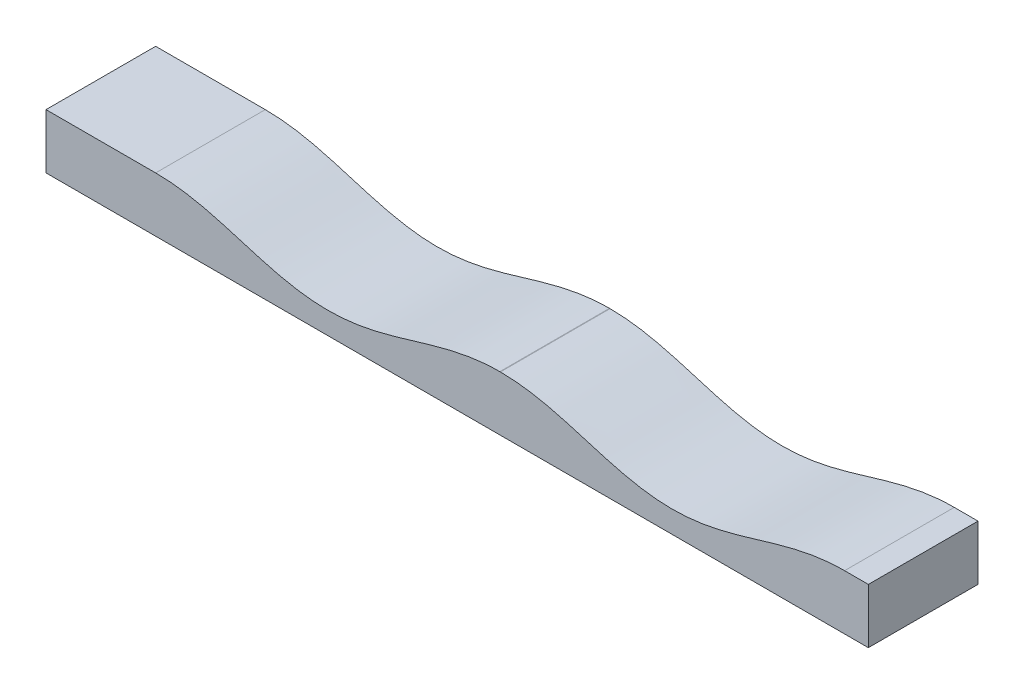
ISO-10303-21;
HEADER;
FILE_DESCRIPTION(('STEP AP214'),'2;1');
FILE_NAME('part.step','',(''),(''),'','','');
FILE_SCHEMA(('AUTOMOTIVE_DESIGN { 1 0 10303 214 1 1 1 1 }'));
ENDSEC;
DATA;
#1=APPLICATION_CONTEXT('core data for automotive mechanical design processes');
#2=APPLICATION_PROTOCOL_DEFINITION('international standard','automotive_design',2000,#1);
#3=PRODUCT_CONTEXT('',#1,'mechanical');
#4=PRODUCT('Part','Part','',(#3));
#5=PRODUCT_RELATED_PRODUCT_CATEGORY('part','',(#4));
#6=PRODUCT_DEFINITION_FORMATION('','',#4);
#7=PRODUCT_DEFINITION_CONTEXT('part definition',#1,'design');
#8=PRODUCT_DEFINITION('design','',#6,#7);
#9=PRODUCT_DEFINITION_SHAPE('','',#8);
#10=(LENGTH_UNIT() NAMED_UNIT(*) SI_UNIT(.MILLI.,.METRE.));
#11=(NAMED_UNIT(*) PLANE_ANGLE_UNIT() SI_UNIT($,.RADIAN.));
#12=(NAMED_UNIT(*) SI_UNIT($,.STERADIAN.) SOLID_ANGLE_UNIT());
#13=UNCERTAINTY_MEASURE_WITH_UNIT(LENGTH_MEASURE(1.E-05),#10,'distance_accuracy_value','');
#14=(GEOMETRIC_REPRESENTATION_CONTEXT(3) GLOBAL_UNCERTAINTY_ASSIGNED_CONTEXT((#13)) GLOBAL_UNIT_ASSIGNED_CONTEXT((#10,
#11,#12)) REPRESENTATION_CONTEXT('',''));
#15=CARTESIAN_POINT('',(0.,0.,0.));
#16=DIRECTION('',(0.,0.,1.));
#17=DIRECTION('',(1.,0.,0.));
#18=AXIS2_PLACEMENT_3D('',#15,#16,#17);
#19=CARTESIAN_POINT('',(0.,10.,0.));
#20=DIRECTION('',(0.,1.,0.));
#21=DIRECTION('',(0.,0.,1.));
#22=AXIS2_PLACEMENT_3D('',#19,#20,#21);
#23=PLANE('',#22);
#24=DIRECTION('',(0.,0.,1.));
#25=VECTOR('',#24,1.);
#26=CARTESIAN_POINT('',(20.,10.,-10.));
#27=LINE('',#26,#25);
#28=CARTESIAN_POINT('',(20.,10.,-10.));
#29=VERTEX_POINT('',#28);
#30=CARTESIAN_POINT('',(20.,10.,10.));
#31=VERTEX_POINT('',#30);
#32=EDGE_CURVE('E129',#29,#31,#27,.T.);
#33=ORIENTED_EDGE('',*,*,#32,.F.);
#34=DIRECTION('',(-1.,0.,0.));
#35=VECTOR('',#34,1.);
#36=CARTESIAN_POINT('',(150.,10.,-10.));
#37=LINE('',#36,#35);
#38=CARTESIAN_POINT('',(0.,10.,-10.));
#39=VERTEX_POINT('',#38);
#40=EDGE_CURVE('E124',#29,#39,#37,.T.);
#41=ORIENTED_EDGE('',*,*,#40,.T.);
#42=DIRECTION('',(0.,0.,1.));
#43=VECTOR('',#42,1.);
#44=CARTESIAN_POINT('',(0.,10.,10.));
#45=LINE('',#44,#43);
#46=CARTESIAN_POINT('',(0.,10.,10.));
#47=VERTEX_POINT('',#46);
#48=EDGE_CURVE('E126',#39,#47,#45,.T.);
#49=ORIENTED_EDGE('',*,*,#48,.T.);
#50=DIRECTION('',(1.,0.,0.));
#51=VECTOR('',#50,1.);
#52=CARTESIAN_POINT('',(150.,10.,9.99999999999998));
#53=LINE('',#52,#51);
#54=EDGE_CURVE('E107',#47,#31,#53,.T.);
#55=ORIENTED_EDGE('',*,*,#54,.T.);
#56=EDGE_LOOP('',(#33,#41,#49,#55));
#57=FACE_BOUND('',#56,.T.);
#58=ADVANCED_FACE('F33',(#57),#23,.T.);
#59=CARTESIAN_POINT('',(150.,10.,-10.));
#60=VERTEX_POINT('',#59);
#61=CARTESIAN_POINT('',(145.663706143612,10.,-10.));
#62=VERTEX_POINT('',#61);
#63=EDGE_CURVE('E132',#60,#62,#37,.T.);
#64=ORIENTED_EDGE('',*,*,#63,.T.);
#65=DIRECTION('',(0.,0.,1.));
#66=VECTOR('',#65,1.);
#67=CARTESIAN_POINT('',(145.663706143612,10.,-10.));
#68=LINE('',#67,#66);
#69=CARTESIAN_POINT('',(145.663706143613,10.,9.99999999999998));
#70=VERTEX_POINT('',#69);
#71=EDGE_CURVE('E145',#62,#70,#68,.T.);
#72=ORIENTED_EDGE('',*,*,#71,.T.);
#73=CARTESIAN_POINT('',(150.,10.,9.99999999999998));
#74=VERTEX_POINT('',#73);
#75=EDGE_CURVE('E140',#70,#74,#53,.T.);
#76=ORIENTED_EDGE('',*,*,#75,.T.);
#77=DIRECTION('',(0.,0.,-1.));
#78=VECTOR('',#77,1.);
#79=CARTESIAN_POINT('',(150.,10.,9.99999999999998));
#80=LINE('',#79,#78);
#81=EDGE_CURVE('E119',#74,#60,#80,.T.);
#82=ORIENTED_EDGE('',*,*,#81,.T.);
#83=EDGE_LOOP('',(#64,#72,#76,#82));
#84=FACE_BOUND('',#83,.T.);
#85=ADVANCED_FACE('F185',(#84),#23,.T.);
#86=CARTESIAN_POINT('',(0.,10.,10.));
#87=DIRECTION('',(1.,0.,0.));
#88=DIRECTION('',(0.,0.,-1.));
#89=AXIS2_PLACEMENT_3D('',#86,#87,#88);
#90=PLANE('',#89);
#91=DIRECTION('',(0.,0.,1.));
#92=VECTOR('',#91,1.);
#93=CARTESIAN_POINT('',(0.,0.,10.));
#94=LINE('',#93,#92);
#95=CARTESIAN_POINT('',(0.,0.,-10.));
#96=VERTEX_POINT('',#95);
#97=CARTESIAN_POINT('',(0.,0.,10.));
#98=VERTEX_POINT('',#97);
#99=EDGE_CURVE('E149',#96,#98,#94,.T.);
#100=ORIENTED_EDGE('',*,*,#99,.T.);
#101=DIRECTION('',(0.,-1.,0.));
#102=VECTOR('',#101,1.);
#103=CARTESIAN_POINT('',(0.,10.,10.));
#104=LINE('',#103,#102);
#105=EDGE_CURVE('E139',#47,#98,#104,.T.);
#106=ORIENTED_EDGE('',*,*,#105,.F.);
#107=ORIENTED_EDGE('',*,*,#48,.F.);
#108=DIRECTION('',(0.,-1.,0.));
#109=VECTOR('',#108,1.);
#110=CARTESIAN_POINT('',(0.,10.,-10.));
#111=LINE('',#110,#109);
#112=EDGE_CURVE('E133',#39,#96,#111,.T.);
#113=ORIENTED_EDGE('',*,*,#112,.T.);
#114=EDGE_LOOP('',(#100,#106,#107,#113));
#115=FACE_BOUND('',#114,.T.);
#116=ADVANCED_FACE('F35',(#115),#90,.F.);
#117=CARTESIAN_POINT('',(150.,10.,9.99999999999998));
#118=DIRECTION('',(0.,0.,-1.));
#119=DIRECTION('',(-1.,0.,0.));
#120=AXIS2_PLACEMENT_3D('',#117,#118,#119);
#121=PLANE('',#120);
#122=DIRECTION('',(1.,0.,0.));
#123=VECTOR('',#122,1.);
#124=CARTESIAN_POINT('',(0.,10.,9.99999999999999));
#125=LINE('',#124,#123);
#126=CARTESIAN_POINT('',(82.7780737696727,10.0000000000001,9.99999999999999));
#127=VERTEX_POINT('',#126);
#128=CARTESIAN_POINT('',(82.8856278761466,10.,9.99999999999999));
#129=VERTEX_POINT('',#128);
#130=EDGE_CURVE('E37',#127,#129,#125,.T.);
#131=ORIENTED_EDGE('',*,*,#130,.F.);
#132=CARTESIAN_POINT('',(19.9999999999975,10.,10.));
#133=CARTESIAN_POINT('',(20.0607614423715,10.,10.));
#134=CARTESIAN_POINT('',(20.1824214553506,9.9995753970691,10.));
#135=CARTESIAN_POINT('',(20.3973010297231,9.99766468458234,10.));
#136=CARTESIAN_POINT('',(20.7149855545771,9.99257239572288,10.));
#137=CARTESIAN_POINT('',(21.1005637112447,9.98303353547104,10.));
#138=CARTESIAN_POINT('',(21.5318509676293,9.96652686291294,10.));
#139=CARTESIAN_POINT('',(22.0362572209401,9.93994091498935,10.));
#140=CARTESIAN_POINT('',(22.6209438510357,9.89964533359765,10.));
#141=CARTESIAN_POINT('',(23.3457874969873,9.83711346640637,10.));
#142=CARTESIAN_POINT('',(24.0967998850118,9.75589638188363,10.));
#143=CARTESIAN_POINT('',(24.8714562356159,9.65480784470362,10.));
#144=CARTESIAN_POINT('',(25.8401527120131,9.50702943030351,10.));
#145=CARTESIAN_POINT('',(26.6877130400076,9.3582480578721,10.));
#146=CARTESIAN_POINT('',(27.5320763279749,9.1920716078163,10.));
#147=CARTESIAN_POINT('',(28.3731353334549,9.01027021530613,10.));
#148=CARTESIAN_POINT('',(29.0440680002337,8.85619443792739,10.));
#149=CARTESIAN_POINT('',(30.1123379454453,8.59757408907099,10.));
#150=CARTESIAN_POINT('',(31.5728561000633,8.21429539495773,10.));
#151=CARTESIAN_POINT('',(33.4199103147685,7.68752673585901,10.));
#152=CARTESIAN_POINT('',(35.6526320552214,7.0168103480453,10.));
#153=CARTESIAN_POINT('',(37.7332722524778,6.39085142574939,10.));
#154=CARTESIAN_POINT('',(39.6691065376285,5.8342663575982,10.));
#155=CARTESIAN_POINT('',(41.872853104551,5.24908154098412,10.));
#156=CARTESIAN_POINT('',(44.6637685236702,4.60848965346651,10.));
#157=CARTESIAN_POINT('',(48.2286943420231,4.04054839894605,10.));
#158=CARTESIAN_POINT('',(52.5867052144305,3.88102484164541,10.));
#159=CARTESIAN_POINT('',(57.201452939956,4.37709005122981,10.));
#160=CARTESIAN_POINT('',(61.687417048679,5.38478965660527,10.));
#161=CARTESIAN_POINT('',(65.9249231356225,6.62915064675429,10.));
#162=CARTESIAN_POINT('',(69.9774506351203,7.87353460738467,10.));
#163=CARTESIAN_POINT('',(74.1045600785184,8.99396689287309,10.));
#164=CARTESIAN_POINT('',(78.3422548229217,9.81457881032495,10.));
#165=CARTESIAN_POINT('',(82.8318529583171,10.1407757520958,10.));
#166=CARTESIAN_POINT('',(87.3214515689638,9.81457806232818,10.));
#167=CARTESIAN_POINT('',(91.5591457236881,8.99396862697276,10.));
#168=CARTESIAN_POINT('',(95.6862561059864,7.87353082037432,10.));
#169=CARTESIAN_POINT('',(99.7387819686486,6.62915770474275,10.));
#170=CARTESIAN_POINT('',(103.976290754997,5.38477812130336,10.));
#171=CARTESIAN_POINT('',(108.462250932461,4.37710595153992,10.));
#172=CARTESIAN_POINT('',(113.077004559588,3.88099935194093,10.));
#173=CARTESIAN_POINT('',(117.435005853124,4.0405901940327,10.));
#174=CARTESIAN_POINT('',(121.41960599233,4.67527178659605,10.));
#175=CARTESIAN_POINT('',(124.770171836118,5.48619692133274,10.));
#176=CARTESIAN_POINT('',(127.52412356252,6.26878856578808,10.));
#177=CARTESIAN_POINT('',(130.011090760973,7.01671326427886,10.));
#178=CARTESIAN_POINT('',(132.243780846713,7.68759639851357,10.));
#179=CARTESIAN_POINT('',(134.256371731303,8.2614501848802,10.));
#180=CARTESIAN_POINT('',(136.05114097296,8.72731142896462,10.));
#181=CARTESIAN_POINT('',(137.625546339694,9.08974664565643,10.));
#182=CARTESIAN_POINT('',(138.975122407524,9.36260296407756,10.));
#183=CARTESIAN_POINT('',(140.280663194219,9.58482608235431,10.));
#184=CARTESIAN_POINT('',(141.395781757496,9.73738392010121,10.));
#185=CARTESIAN_POINT('',(142.317885087465,9.83711244946201,10.));
#186=CARTESIAN_POINT('',(143.042775212016,9.89964574609589,10.));
#187=CARTESIAN_POINT('',(143.62744465041,9.93994077490814,10.));
#188=CARTESIAN_POINT('',(144.131855587126,9.96652687676075,10.));
#189=CARTESIAN_POINT('',(144.563142561625,9.98303353993483,10.));
#190=CARTESIAN_POINT('',(144.948720651122,9.99257239768348,10.));
#191=CARTESIAN_POINT('',(145.266405121889,9.99766468474359,10.));
#192=CARTESIAN_POINT('',(145.481284705766,9.99957539731208,10.));
#193=CARTESIAN_POINT('',(145.602944701242,10.,10.));
#194=CARTESIAN_POINT('',(145.663706143613,10.,10.));
#195=B_SPLINE_CURVE_WITH_KNOTS('',4,(#132,#133,#134,#135,#136,#137,#138,#139,#140,#141,#142,
#143,#144,#145,#146,#147,#148,#149,#150,#151,#152,#153,#154,#155,#156,#157,#158,#159,#160,#161,
#162,#163,#164,#165,#166,#167,#168,#169,#170,#171,#172,#173,#174,#175,#176,#177,#178,#179,#180,
#181,#182,#183,#184,#185,#186,#187,#188,#189,#190,#191,#192,#193,#194),.UNSPECIFIED.,.F.,.F.,(5,
1,1,1,1,1,1,1,1,1,1,1,1,1,1,1,1,1,1,1,1,1,1,1,1,1,1,1,1,1,1,1,1,1,1,1,1,1,1,1,1,1,1,1,1,1,1,1,1,
1,1,1,1,1,1,1,1,1,1,5),(0.082984761646715,0.0848769766356949,0.0867691916246747,
0.0886614066136545,0.0905536216026343,0.094338051580594,0.0981224815585536,0.101906911536513,
0.105691341514473,0.113260201470392,0.117730016392172,0.122199831313951,0.13113946115751,
0.135609276079289,0.140079091001069,0.144548905922848,0.149018720844627,0.164156480476509,
0.179294240108391,0.194431999740273,0.209569759372155,0.22058934305514,0.231608926738126,
0.253648094104097,0.283923524750503,0.314198968730596,0.344474466408915,0.37383219417635,
0.403189921943786,0.428888353248252,0.454586784552718,0.484862298741238,0.515137701258754,
0.545413215447273,0.571111646751734,0.596810078056196,0.626167805823633,0.65552553359107,
0.685801031269389,0.71607647524948,0.746351905895884,0.76839107326185,0.790430240627816,
0.805568000259697,0.820705759891578,0.835843519523459,0.850981279155341,0.859920908998902,
0.868860538842462,0.877800168686023,0.886739798529584,0.894308658485508,0.89809308846347,
0.901877518441432,0.905661948419394,0.909446378397356,0.911338593386337,0.913230808375318,
0.9151230233643,0.917015238353281),.UNSPECIFIED.);
#196=EDGE_CURVE('E207',#31,#127,#195,.T.);
#197=ORIENTED_EDGE('',*,*,#196,.F.);
#198=ORIENTED_EDGE('',*,*,#54,.F.);
#199=ORIENTED_EDGE('',*,*,#105,.T.);
#200=DIRECTION('',(1.,0.,0.));
#201=VECTOR('',#200,1.);
#202=CARTESIAN_POINT('',(150.,0.,9.99999999999998));
#203=LINE('',#202,#201);
#204=CARTESIAN_POINT('',(150.,0.,9.99999999999998));
#205=VERTEX_POINT('',#204);
#206=EDGE_CURVE('E82',#98,#205,#203,.T.);
#207=ORIENTED_EDGE('',*,*,#206,.T.);
#208=DIRECTION('',(0.,-1.,0.));
#209=VECTOR('',#208,1.);
#210=CARTESIAN_POINT('',(150.,10.,9.99999999999998));
#211=LINE('',#210,#209);
#212=EDGE_CURVE('E154',#74,#205,#211,.T.);
#213=ORIENTED_EDGE('',*,*,#212,.F.);
#214=ORIENTED_EDGE('',*,*,#75,.F.);
#215=CARTESIAN_POINT('',(19.9999999999975,10.,10.));
#216=CARTESIAN_POINT('',(20.0607614423715,10.,10.));
#217=CARTESIAN_POINT('',(20.1824214553506,9.9995753970691,10.));
#218=CARTESIAN_POINT('',(20.3973010297231,9.99766468458234,10.));
#219=CARTESIAN_POINT('',(20.7149855545771,9.99257239572288,10.));
#220=CARTESIAN_POINT('',(21.1005637112447,9.98303353547104,10.));
#221=CARTESIAN_POINT('',(21.5318509676293,9.96652686291294,10.));
#222=CARTESIAN_POINT('',(22.0362572209401,9.93994091498935,10.));
#223=CARTESIAN_POINT('',(22.6209438510357,9.89964533359765,10.));
#224=CARTESIAN_POINT('',(23.3457874969873,9.83711346640637,10.));
#225=CARTESIAN_POINT('',(24.0967998850118,9.75589638188363,10.));
#226=CARTESIAN_POINT('',(24.8714562356159,9.65480784470362,10.));
#227=CARTESIAN_POINT('',(25.8401527120131,9.50702943030351,10.));
#228=CARTESIAN_POINT('',(26.6877130400076,9.3582480578721,10.));
#229=CARTESIAN_POINT('',(27.5320763279749,9.1920716078163,10.));
#230=CARTESIAN_POINT('',(28.3731353334549,9.01027021530613,10.));
#231=CARTESIAN_POINT('',(29.0440680002337,8.85619443792739,10.));
#232=CARTESIAN_POINT('',(30.1123379454453,8.59757408907099,10.));
#233=CARTESIAN_POINT('',(31.5728561000633,8.21429539495773,10.));
#234=CARTESIAN_POINT('',(33.4199103147685,7.68752673585901,10.));
#235=CARTESIAN_POINT('',(35.6526320552214,7.0168103480453,10.));
#236=CARTESIAN_POINT('',(37.7332722524778,6.39085142574939,10.));
#237=CARTESIAN_POINT('',(39.6691065376285,5.8342663575982,10.));
#238=CARTESIAN_POINT('',(41.872853104551,5.24908154098412,10.));
#239=CARTESIAN_POINT('',(44.6637685236702,4.60848965346651,10.));
#240=CARTESIAN_POINT('',(48.2286943420231,4.04054839894605,10.));
#241=CARTESIAN_POINT('',(52.5867052144305,3.88102484164541,10.));
#242=CARTESIAN_POINT('',(57.201452939956,4.37709005122981,10.));
#243=CARTESIAN_POINT('',(61.687417048679,5.38478965660527,10.));
#244=CARTESIAN_POINT('',(65.9249231356225,6.62915064675429,10.));
#245=CARTESIAN_POINT('',(69.9774506351203,7.87353460738467,10.));
#246=CARTESIAN_POINT('',(74.1045600785184,8.99396689287309,10.));
#247=CARTESIAN_POINT('',(78.3422548229217,9.81457881032495,10.));
#248=CARTESIAN_POINT('',(82.8318529583171,10.1407757520958,10.));
#249=CARTESIAN_POINT('',(87.3214515689638,9.81457806232818,10.));
#250=CARTESIAN_POINT('',(91.5591457236881,8.99396862697276,10.));
#251=CARTESIAN_POINT('',(95.6862561059864,7.87353082037432,10.));
#252=CARTESIAN_POINT('',(99.7387819686486,6.62915770474275,10.));
#253=CARTESIAN_POINT('',(103.976290754997,5.38477812130336,10.));
#254=CARTESIAN_POINT('',(108.462250932461,4.37710595153992,10.));
#255=CARTESIAN_POINT('',(113.077004559588,3.88099935194093,10.));
#256=CARTESIAN_POINT('',(117.435005853124,4.0405901940327,10.));
#257=CARTESIAN_POINT('',(121.41960599233,4.67527178659605,10.));
#258=CARTESIAN_POINT('',(124.770171836118,5.48619692133274,10.));
#259=CARTESIAN_POINT('',(127.52412356252,6.26878856578808,10.));
#260=CARTESIAN_POINT('',(130.011090760973,7.01671326427886,10.));
#261=CARTESIAN_POINT('',(132.243780846713,7.68759639851357,10.));
#262=CARTESIAN_POINT('',(134.256371731303,8.2614501848802,10.));
#263=CARTESIAN_POINT('',(136.05114097296,8.72731142896462,10.));
#264=CARTESIAN_POINT('',(137.625546339694,9.08974664565643,10.));
#265=CARTESIAN_POINT('',(138.975122407524,9.36260296407756,10.));
#266=CARTESIAN_POINT('',(140.280663194219,9.58482608235431,10.));
#267=CARTESIAN_POINT('',(141.395781757496,9.73738392010121,10.));
#268=CARTESIAN_POINT('',(142.317885087465,9.83711244946201,10.));
#269=CARTESIAN_POINT('',(143.042775212016,9.89964574609589,10.));
#270=CARTESIAN_POINT('',(143.62744465041,9.93994077490814,10.));
#271=CARTESIAN_POINT('',(144.131855587126,9.96652687676075,10.));
#272=CARTESIAN_POINT('',(144.563142561625,9.98303353993483,10.));
#273=CARTESIAN_POINT('',(144.948720651122,9.99257239768348,10.));
#274=CARTESIAN_POINT('',(145.266405121889,9.99766468474359,10.));
#275=CARTESIAN_POINT('',(145.481284705766,9.99957539731208,10.));
#276=CARTESIAN_POINT('',(145.602944701242,10.,10.));
#277=CARTESIAN_POINT('',(145.663706143613,10.,10.));
#278=B_SPLINE_CURVE_WITH_KNOTS('',4,(#215,#216,#217,#218,#219,#220,#221,#222,#223,#224,#225,
#226,#227,#228,#229,#230,#231,#232,#233,#234,#235,#236,#237,#238,#239,#240,#241,#242,#243,#244,
#245,#246,#247,#248,#249,#250,#251,#252,#253,#254,#255,#256,#257,#258,#259,#260,#261,#262,#263,
#264,#265,#266,#267,#268,#269,#270,#271,#272,#273,#274,#275,#276,#277),.UNSPECIFIED.,.F.,.F.,(5,
1,1,1,1,1,1,1,1,1,1,1,1,1,1,1,1,1,1,1,1,1,1,1,1,1,1,1,1,1,1,1,1,1,1,1,1,1,1,1,1,1,1,1,1,1,1,1,1,
1,1,1,1,1,1,1,1,1,1,5),(0.082984761646715,0.0848769766356949,0.0867691916246747,
0.0886614066136545,0.0905536216026343,0.094338051580594,0.0981224815585536,0.101906911536513,
0.105691341514473,0.113260201470392,0.117730016392172,0.122199831313951,0.13113946115751,
0.135609276079289,0.140079091001069,0.144548905922848,0.149018720844627,0.164156480476509,
0.179294240108391,0.194431999740273,0.209569759372155,0.22058934305514,0.231608926738126,
0.253648094104097,0.283923524750503,0.314198968730596,0.344474466408915,0.37383219417635,
0.403189921943786,0.428888353248252,0.454586784552718,0.484862298741238,0.515137701258754,
0.545413215447273,0.571111646751734,0.596810078056196,0.626167805823633,0.65552553359107,
0.685801031269389,0.71607647524948,0.746351905895884,0.76839107326185,0.790430240627816,
0.805568000259697,0.820705759891578,0.835843519523459,0.850981279155341,0.859920908998902,
0.868860538842462,0.877800168686023,0.886739798529584,0.894308658485508,0.89809308846347,
0.901877518441432,0.905661948419394,0.909446378397356,0.911338593386337,0.913230808375318,
0.9151230233643,0.917015238353281),.UNSPECIFIED.);
#279=EDGE_CURVE('E52',#129,#70,#278,.T.);
#280=ORIENTED_EDGE('',*,*,#279,.F.);
#281=EDGE_LOOP('',(#131,#197,#198,#199,#207,#213,#214,#280));
#282=FACE_BOUND('',#281,.T.);
#283=ADVANCED_FACE('F160',(#282),#121,.F.);
#284=CARTESIAN_POINT('',(150.,10.,9.99999999999998));
#285=DIRECTION('',(-1.,0.,0.));
#286=DIRECTION('',(0.,0.,1.));
#287=AXIS2_PLACEMENT_3D('',#284,#285,#286);
#288=PLANE('',#287);
#289=DIRECTION('',(0.,0.,-1.));
#290=VECTOR('',#289,1.);
#291=CARTESIAN_POINT('',(150.,0.,9.99999999999998));
#292=LINE('',#291,#290);
#293=CARTESIAN_POINT('',(150.,0.,-10.));
#294=VERTEX_POINT('',#293);
#295=EDGE_CURVE('E92',#205,#294,#292,.T.);
#296=ORIENTED_EDGE('',*,*,#295,.T.);
#297=DIRECTION('',(0.,-1.,0.));
#298=VECTOR('',#297,1.);
#299=CARTESIAN_POINT('',(150.,10.,-10.));
#300=LINE('',#299,#298);
#301=EDGE_CURVE('E137',#60,#294,#300,.T.);
#302=ORIENTED_EDGE('',*,*,#301,.F.);
#303=ORIENTED_EDGE('',*,*,#81,.F.);
#304=ORIENTED_EDGE('',*,*,#212,.T.);
#305=EDGE_LOOP('',(#296,#302,#303,#304));
#306=FACE_BOUND('',#305,.T.);
#307=ADVANCED_FACE('F190',(#306),#288,.F.);
#308=CARTESIAN_POINT('',(150.,10.,-10.));
#309=DIRECTION('',(0.,0.,1.));
#310=DIRECTION('',(1.,0.,0.));
#311=AXIS2_PLACEMENT_3D('',#308,#309,#310);
#312=PLANE('',#311);
#313=ORIENTED_EDGE('',*,*,#40,.F.);
#314=CARTESIAN_POINT('',(19.9999999999975,10.,-10.));
#315=CARTESIAN_POINT('',(20.0607614423715,10.,-10.));
#316=CARTESIAN_POINT('',(20.1824214553506,9.9995753970691,-10.));
#317=CARTESIAN_POINT('',(20.3973010297231,9.99766468458234,-10.));
#318=CARTESIAN_POINT('',(20.7149855545771,9.99257239572288,-10.));
#319=CARTESIAN_POINT('',(21.1005637112447,9.98303353547104,-10.));
#320=CARTESIAN_POINT('',(21.5318509676293,9.96652686291294,-10.));
#321=CARTESIAN_POINT('',(22.0362572209401,9.93994091498935,-10.));
#322=CARTESIAN_POINT('',(22.6209438510357,9.89964533359765,-10.));
#323=CARTESIAN_POINT('',(23.3457874969873,9.83711346640637,-10.));
#324=CARTESIAN_POINT('',(24.0967998850118,9.75589638188363,-10.));
#325=CARTESIAN_POINT('',(24.8714562356159,9.65480784470362,-10.));
#326=CARTESIAN_POINT('',(25.8401527120131,9.50702943030351,-10.));
#327=CARTESIAN_POINT('',(26.6877130400076,9.3582480578721,-10.));
#328=CARTESIAN_POINT('',(27.5320763279749,9.1920716078163,-10.));
#329=CARTESIAN_POINT('',(28.3731353334549,9.01027021530613,-10.));
#330=CARTESIAN_POINT('',(29.0440680002337,8.85619443792739,-10.));
#331=CARTESIAN_POINT('',(30.1123379454453,8.59757408907099,-10.));
#332=CARTESIAN_POINT('',(31.5728561000633,8.21429539495773,-10.));
#333=CARTESIAN_POINT('',(33.4199103147685,7.68752673585901,-10.));
#334=CARTESIAN_POINT('',(35.6526320552214,7.0168103480453,-10.));
#335=CARTESIAN_POINT('',(37.7332722524778,6.39085142574939,-10.));
#336=CARTESIAN_POINT('',(39.6691065376285,5.8342663575982,-10.));
#337=CARTESIAN_POINT('',(41.872853104551,5.24908154098412,-10.));
#338=CARTESIAN_POINT('',(44.6637685236702,4.60848965346651,-10.));
#339=CARTESIAN_POINT('',(48.2286943420231,4.04054839894605,-10.));
#340=CARTESIAN_POINT('',(52.5867052144305,3.88102484164541,-10.));
#341=CARTESIAN_POINT('',(57.201452939956,4.37709005122981,-10.));
#342=CARTESIAN_POINT('',(61.687417048679,5.38478965660527,-10.));
#343=CARTESIAN_POINT('',(65.9249231356225,6.62915064675429,-10.));
#344=CARTESIAN_POINT('',(69.9774506351203,7.87353460738467,-10.));
#345=CARTESIAN_POINT('',(74.1045600785184,8.99396689287309,-10.));
#346=CARTESIAN_POINT('',(78.3422548229217,9.81457881032495,-10.));
#347=CARTESIAN_POINT('',(82.8318529583171,10.1407757520958,-10.));
#348=CARTESIAN_POINT('',(87.3214515689638,9.81457806232818,-10.));
#349=CARTESIAN_POINT('',(91.5591457236881,8.99396862697276,-10.));
#350=CARTESIAN_POINT('',(95.6862561059864,7.87353082037432,-10.));
#351=CARTESIAN_POINT('',(99.7387819686486,6.62915770474275,-10.));
#352=CARTESIAN_POINT('',(103.976290754997,5.38477812130336,-10.));
#353=CARTESIAN_POINT('',(108.462250932461,4.37710595153992,-10.));
#354=CARTESIAN_POINT('',(113.077004559588,3.88099935194093,-10.));
#355=CARTESIAN_POINT('',(117.435005853124,4.0405901940327,-10.));
#356=CARTESIAN_POINT('',(121.41960599233,4.67527178659605,-10.));
#357=CARTESIAN_POINT('',(124.770171836118,5.48619692133274,-10.));
#358=CARTESIAN_POINT('',(127.52412356252,6.26878856578808,-10.));
#359=CARTESIAN_POINT('',(130.011090760973,7.01671326427886,-10.));
#360=CARTESIAN_POINT('',(132.243780846713,7.68759639851357,-10.));
#361=CARTESIAN_POINT('',(134.256371731303,8.2614501848802,-10.));
#362=CARTESIAN_POINT('',(136.05114097296,8.72731142896462,-10.));
#363=CARTESIAN_POINT('',(137.625546339694,9.08974664565643,-10.));
#364=CARTESIAN_POINT('',(138.975122407524,9.36260296407756,-10.));
#365=CARTESIAN_POINT('',(140.280663194219,9.58482608235431,-10.));
#366=CARTESIAN_POINT('',(141.395781757496,9.73738392010121,-10.));
#367=CARTESIAN_POINT('',(142.317885087465,9.83711244946201,-10.));
#368=CARTESIAN_POINT('',(143.042775212016,9.89964574609589,-10.));
#369=CARTESIAN_POINT('',(143.62744465041,9.93994077490814,-10.));
#370=CARTESIAN_POINT('',(144.131855587126,9.96652687676075,-10.));
#371=CARTESIAN_POINT('',(144.563142561625,9.98303353993483,-10.));
#372=CARTESIAN_POINT('',(144.948720651122,9.99257239768348,-10.));
#373=CARTESIAN_POINT('',(145.266405121889,9.99766468474359,-10.));
#374=CARTESIAN_POINT('',(145.481284705766,9.99957539731208,-10.));
#375=CARTESIAN_POINT('',(145.602944701242,10.,-10.));
#376=CARTESIAN_POINT('',(145.663706143613,10.,-10.));
#377=B_SPLINE_CURVE_WITH_KNOTS('',4,(#314,#315,#316,#317,#318,#319,#320,#321,#322,#323,#324,
#325,#326,#327,#328,#329,#330,#331,#332,#333,#334,#335,#336,#337,#338,#339,#340,#341,#342,#343,
#344,#345,#346,#347,#348,#349,#350,#351,#352,#353,#354,#355,#356,#357,#358,#359,#360,#361,#362,
#363,#364,#365,#366,#367,#368,#369,#370,#371,#372,#373,#374,#375,#376),.UNSPECIFIED.,.F.,.F.,(5,
1,1,1,1,1,1,1,1,1,1,1,1,1,1,1,1,1,1,1,1,1,1,1,1,1,1,1,1,1,1,1,1,1,1,1,1,1,1,1,1,1,1,1,1,1,1,1,1,
1,1,1,1,1,1,1,1,1,1,5),(0.082984761646715,0.0848769766356949,0.0867691916246747,
0.0886614066136545,0.0905536216026343,0.094338051580594,0.0981224815585536,0.101906911536513,
0.105691341514473,0.113260201470392,0.117730016392172,0.122199831313951,0.13113946115751,
0.135609276079289,0.140079091001069,0.144548905922848,0.149018720844627,0.164156480476509,
0.179294240108391,0.194431999740273,0.209569759372155,0.22058934305514,0.231608926738126,
0.253648094104097,0.283923524750503,0.314198968730596,0.344474466408915,0.37383219417635,
0.403189921943786,0.428888353248252,0.454586784552718,0.484862298741238,0.515137701258754,
0.545413215447273,0.571111646751734,0.596810078056196,0.626167805823633,0.65552553359107,
0.685801031269389,0.71607647524948,0.746351905895884,0.76839107326185,0.790430240627816,
0.805568000259697,0.820705759891578,0.835843519523459,0.850981279155341,0.859920908998902,
0.868860538842462,0.877800168686023,0.886739798529584,0.894308658485508,0.89809308846347,
0.901877518441432,0.905661948419394,0.909446378397356,0.911338593386337,0.913230808375318,
0.9151230233643,0.917015238353281),.UNSPECIFIED.);
#378=CARTESIAN_POINT('',(82.7780737696727,10.0000000000001,-10.));
#379=VERTEX_POINT('',#378);
#380=EDGE_CURVE('E205',#29,#379,#377,.T.);
#381=ORIENTED_EDGE('',*,*,#380,.T.);
#382=DIRECTION('',(1.,0.,0.));
#383=VECTOR('',#382,1.);
#384=CARTESIAN_POINT('',(0.,10.,-10.));
#385=LINE('',#384,#383);
#386=CARTESIAN_POINT('',(82.8856278761466,10.,-10.));
#387=VERTEX_POINT('',#386);
#388=EDGE_CURVE('E74',#387,#379,#385,.F.);
#389=ORIENTED_EDGE('',*,*,#388,.F.);
#390=CARTESIAN_POINT('',(19.9999999999975,10.,-10.));
#391=CARTESIAN_POINT('',(20.0607614423715,10.,-10.));
#392=CARTESIAN_POINT('',(20.1824214553506,9.9995753970691,-10.));
#393=CARTESIAN_POINT('',(20.3973010297231,9.99766468458234,-10.));
#394=CARTESIAN_POINT('',(20.7149855545771,9.99257239572288,-10.));
#395=CARTESIAN_POINT('',(21.1005637112447,9.98303353547104,-10.));
#396=CARTESIAN_POINT('',(21.5318509676293,9.96652686291294,-10.));
#397=CARTESIAN_POINT('',(22.0362572209401,9.93994091498935,-10.));
#398=CARTESIAN_POINT('',(22.6209438510357,9.89964533359765,-10.));
#399=CARTESIAN_POINT('',(23.3457874969873,9.83711346640637,-10.));
#400=CARTESIAN_POINT('',(24.0967998850118,9.75589638188363,-10.));
#401=CARTESIAN_POINT('',(24.8714562356159,9.65480784470362,-10.));
#402=CARTESIAN_POINT('',(25.8401527120131,9.50702943030351,-10.));
#403=CARTESIAN_POINT('',(26.6877130400076,9.3582480578721,-10.));
#404=CARTESIAN_POINT('',(27.5320763279749,9.1920716078163,-10.));
#405=CARTESIAN_POINT('',(28.3731353334549,9.01027021530613,-10.));
#406=CARTESIAN_POINT('',(29.0440680002337,8.85619443792739,-10.));
#407=CARTESIAN_POINT('',(30.1123379454453,8.59757408907099,-10.));
#408=CARTESIAN_POINT('',(31.5728561000633,8.21429539495773,-10.));
#409=CARTESIAN_POINT('',(33.4199103147685,7.68752673585901,-10.));
#410=CARTESIAN_POINT('',(35.6526320552214,7.0168103480453,-10.));
#411=CARTESIAN_POINT('',(37.7332722524778,6.39085142574939,-10.));
#412=CARTESIAN_POINT('',(39.6691065376285,5.8342663575982,-10.));
#413=CARTESIAN_POINT('',(41.872853104551,5.24908154098412,-10.));
#414=CARTESIAN_POINT('',(44.6637685236702,4.60848965346651,-10.));
#415=CARTESIAN_POINT('',(48.2286943420231,4.04054839894605,-10.));
#416=CARTESIAN_POINT('',(52.5867052144305,3.88102484164541,-10.));
#417=CARTESIAN_POINT('',(57.201452939956,4.37709005122981,-10.));
#418=CARTESIAN_POINT('',(61.687417048679,5.38478965660527,-10.));
#419=CARTESIAN_POINT('',(65.9249231356225,6.62915064675429,-10.));
#420=CARTESIAN_POINT('',(69.9774506351203,7.87353460738467,-10.));
#421=CARTESIAN_POINT('',(74.1045600785184,8.99396689287309,-10.));
#422=CARTESIAN_POINT('',(78.3422548229217,9.81457881032495,-10.));
#423=CARTESIAN_POINT('',(82.8318529583171,10.1407757520958,-10.));
#424=CARTESIAN_POINT('',(87.3214515689638,9.81457806232818,-10.));
#425=CARTESIAN_POINT('',(91.5591457236881,8.99396862697276,-10.));
#426=CARTESIAN_POINT('',(95.6862561059864,7.87353082037432,-10.));
#427=CARTESIAN_POINT('',(99.7387819686486,6.62915770474275,-10.));
#428=CARTESIAN_POINT('',(103.976290754997,5.38477812130336,-10.));
#429=CARTESIAN_POINT('',(108.462250932461,4.37710595153992,-10.));
#430=CARTESIAN_POINT('',(113.077004559588,3.88099935194093,-10.));
#431=CARTESIAN_POINT('',(117.435005853124,4.0405901940327,-10.));
#432=CARTESIAN_POINT('',(121.41960599233,4.67527178659605,-10.));
#433=CARTESIAN_POINT('',(124.770171836118,5.48619692133274,-10.));
#434=CARTESIAN_POINT('',(127.52412356252,6.26878856578808,-10.));
#435=CARTESIAN_POINT('',(130.011090760973,7.01671326427886,-10.));
#436=CARTESIAN_POINT('',(132.243780846713,7.68759639851357,-10.));
#437=CARTESIAN_POINT('',(134.256371731303,8.2614501848802,-10.));
#438=CARTESIAN_POINT('',(136.05114097296,8.72731142896462,-10.));
#439=CARTESIAN_POINT('',(137.625546339694,9.08974664565643,-10.));
#440=CARTESIAN_POINT('',(138.975122407524,9.36260296407756,-10.));
#441=CARTESIAN_POINT('',(140.280663194219,9.58482608235431,-10.));
#442=CARTESIAN_POINT('',(141.395781757496,9.73738392010121,-10.));
#443=CARTESIAN_POINT('',(142.317885087465,9.83711244946201,-10.));
#444=CARTESIAN_POINT('',(143.042775212016,9.89964574609589,-10.));
#445=CARTESIAN_POINT('',(143.62744465041,9.93994077490814,-10.));
#446=CARTESIAN_POINT('',(144.131855587126,9.96652687676075,-10.));
#447=CARTESIAN_POINT('',(144.563142561625,9.98303353993483,-10.));
#448=CARTESIAN_POINT('',(144.948720651122,9.99257239768348,-10.));
#449=CARTESIAN_POINT('',(145.266405121889,9.99766468474359,-10.));
#450=CARTESIAN_POINT('',(145.481284705766,9.99957539731208,-10.));
#451=CARTESIAN_POINT('',(145.602944701242,10.,-10.));
#452=CARTESIAN_POINT('',(145.663706143613,10.,-10.));
#453=B_SPLINE_CURVE_WITH_KNOTS('',4,(#390,#391,#392,#393,#394,#395,#396,#397,#398,#399,#400,
#401,#402,#403,#404,#405,#406,#407,#408,#409,#410,#411,#412,#413,#414,#415,#416,#417,#418,#419,
#420,#421,#422,#423,#424,#425,#426,#427,#428,#429,#430,#431,#432,#433,#434,#435,#436,#437,#438,
#439,#440,#441,#442,#443,#444,#445,#446,#447,#448,#449,#450,#451,#452),.UNSPECIFIED.,.F.,.F.,(5,
1,1,1,1,1,1,1,1,1,1,1,1,1,1,1,1,1,1,1,1,1,1,1,1,1,1,1,1,1,1,1,1,1,1,1,1,1,1,1,1,1,1,1,1,1,1,1,1,
1,1,1,1,1,1,1,1,1,1,5),(0.082984761646715,0.0848769766356949,0.0867691916246747,
0.0886614066136545,0.0905536216026343,0.094338051580594,0.0981224815585536,0.101906911536513,
0.105691341514473,0.113260201470392,0.117730016392172,0.122199831313951,0.13113946115751,
0.135609276079289,0.140079091001069,0.144548905922848,0.149018720844627,0.164156480476509,
0.179294240108391,0.194431999740273,0.209569759372155,0.22058934305514,0.231608926738126,
0.253648094104097,0.283923524750503,0.314198968730596,0.344474466408915,0.37383219417635,
0.403189921943786,0.428888353248252,0.454586784552718,0.484862298741238,0.515137701258754,
0.545413215447273,0.571111646751734,0.596810078056196,0.626167805823633,0.65552553359107,
0.685801031269389,0.71607647524948,0.746351905895884,0.76839107326185,0.790430240627816,
0.805568000259697,0.820705759891578,0.835843519523459,0.850981279155341,0.859920908998902,
0.868860538842462,0.877800168686023,0.886739798529584,0.894308658485508,0.89809308846347,
0.901877518441432,0.905661948419394,0.909446378397356,0.911338593386337,0.913230808375318,
0.9151230233643,0.917015238353281),.UNSPECIFIED.);
#454=EDGE_CURVE('E67',#387,#62,#453,.T.);
#455=ORIENTED_EDGE('',*,*,#454,.T.);
#456=ORIENTED_EDGE('',*,*,#63,.F.);
#457=ORIENTED_EDGE('',*,*,#301,.T.);
#458=DIRECTION('',(-1.,0.,0.));
#459=VECTOR('',#458,1.);
#460=CARTESIAN_POINT('',(150.,0.,-10.));
#461=LINE('',#460,#459);
#462=EDGE_CURVE('E99',#294,#96,#461,.T.);
#463=ORIENTED_EDGE('',*,*,#462,.T.);
#464=ORIENTED_EDGE('',*,*,#112,.F.);
#465=EDGE_LOOP('',(#313,#381,#389,#455,#456,#457,#463,#464));
#466=FACE_BOUND('',#465,.T.);
#467=ADVANCED_FACE('F134',(#466),#312,.F.);
#468=ORIENTED_EDGE('',*,*,#388,.T.);
#469=DIRECTION('',(0.,0.,1.));
#470=VECTOR('',#469,1.);
#471=CARTESIAN_POINT('',(82.7780737696727,10.0000000000001,-10.));
#472=LINE('',#471,#470);
#473=EDGE_CURVE('E11',#127,#379,#472,.F.);
#474=ORIENTED_EDGE('',*,*,#473,.F.);
#475=ORIENTED_EDGE('',*,*,#130,.T.);
#476=DIRECTION('',(0.,0.,1.));
#477=VECTOR('',#476,1.);
#478=CARTESIAN_POINT('',(82.8856278761466,10.,-10.));
#479=LINE('',#478,#477);
#480=EDGE_CURVE('E43',#387,#129,#479,.T.);
#481=ORIENTED_EDGE('',*,*,#480,.F.);
#482=EDGE_LOOP('',(#468,#474,#475,#481));
#483=FACE_BOUND('',#482,.T.);
#484=ADVANCED_FACE('F182',(#483),#23,.T.);
#485=CARTESIAN_POINT('',(0.,0.,0.));
#486=DIRECTION('',(0.,1.,0.));
#487=DIRECTION('',(0.,0.,1.));
#488=AXIS2_PLACEMENT_3D('',#485,#486,#487);
#489=PLANE('',#488);
#490=ORIENTED_EDGE('',*,*,#99,.F.);
#491=ORIENTED_EDGE('',*,*,#462,.F.);
#492=ORIENTED_EDGE('',*,*,#295,.F.);
#493=ORIENTED_EDGE('',*,*,#206,.F.);
#494=EDGE_LOOP('',(#490,#491,#492,#493));
#495=FACE_BOUND('',#494,.T.);
#496=ADVANCED_FACE('F181',(#495),#489,.F.);
#497=DIRECTION('',(0.,0.,1.));
#498=VECTOR('',#497,1.);
#499=SURFACE_OF_LINEAR_EXTRUSION('',#453,#498);
#500=ORIENTED_EDGE('',*,*,#480,.T.);
#501=ORIENTED_EDGE('',*,*,#279,.T.);
#502=ORIENTED_EDGE('',*,*,#71,.F.);
#503=ORIENTED_EDGE('',*,*,#454,.F.);
#504=EDGE_LOOP('',(#500,#501,#502,#503));
#505=FACE_BOUND('',#504,.T.);
#506=ADVANCED_FACE('F157',(#505),#499,.F.);
#507=DIRECTION('',(0.,0.,1.));
#508=VECTOR('',#507,1.);
#509=SURFACE_OF_LINEAR_EXTRUSION('',#377,#508);
#510=ORIENTED_EDGE('',*,*,#473,.T.);
#511=ORIENTED_EDGE('',*,*,#380,.F.);
#512=ORIENTED_EDGE('',*,*,#32,.T.);
#513=ORIENTED_EDGE('',*,*,#196,.T.);
#514=EDGE_LOOP('',(#510,#511,#512,#513));
#515=FACE_BOUND('',#514,.T.);
#516=ADVANCED_FACE('F180',(#515),#509,.F.);
#517=CLOSED_SHELL('',(#58,#85,#116,#283,#307,#467,#484,#496,#506,#516));
#518=MANIFOLD_SOLID_BREP('B2',#517);
#519=ADVANCED_BREP_SHAPE_REPRESENTATION('',(#18,#518),#14);
#520=SHAPE_DEFINITION_REPRESENTATION(#9,#519);
ENDSEC;
END-ISO-10303-21;
